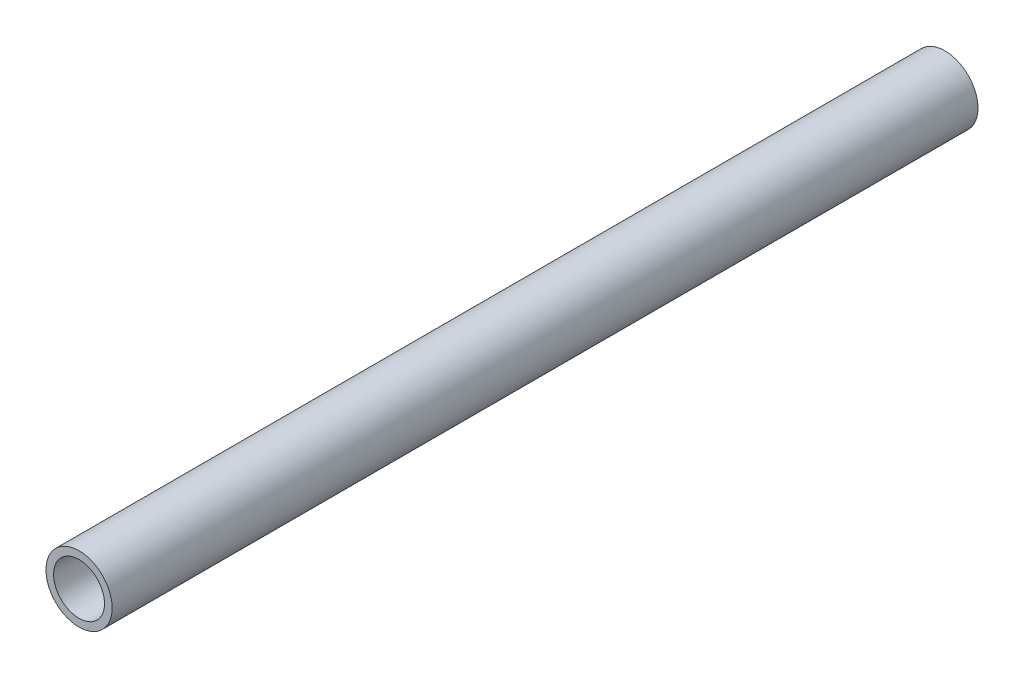
ISO-10303-21;
HEADER;
FILE_DESCRIPTION(('STEP AP214'),'2;1');
FILE_NAME('part.step','',(''),(''),'','','');
FILE_SCHEMA(('AUTOMOTIVE_DESIGN { 1 0 10303 214 1 1 1 1 }'));
ENDSEC;
DATA;
#1=APPLICATION_CONTEXT('core data for automotive mechanical design processes');
#2=APPLICATION_PROTOCOL_DEFINITION('international standard','automotive_design',2000,#1);
#3=PRODUCT_CONTEXT('',#1,'mechanical');
#4=PRODUCT('Part','Part','',(#3));
#5=PRODUCT_RELATED_PRODUCT_CATEGORY('part','',(#4));
#6=PRODUCT_DEFINITION_FORMATION('','',#4);
#7=PRODUCT_DEFINITION_CONTEXT('part definition',#1,'design');
#8=PRODUCT_DEFINITION('design','',#6,#7);
#9=PRODUCT_DEFINITION_SHAPE('','',#8);
#10=(LENGTH_UNIT() NAMED_UNIT(*) SI_UNIT(.MILLI.,.METRE.));
#11=(NAMED_UNIT(*) PLANE_ANGLE_UNIT() SI_UNIT($,.RADIAN.));
#12=(NAMED_UNIT(*) SI_UNIT($,.STERADIAN.) SOLID_ANGLE_UNIT());
#13=UNCERTAINTY_MEASURE_WITH_UNIT(LENGTH_MEASURE(1.E-05),#10,'distance_accuracy_value','');
#14=(GEOMETRIC_REPRESENTATION_CONTEXT(3) GLOBAL_UNCERTAINTY_ASSIGNED_CONTEXT((#13)) GLOBAL_UNIT_ASSIGNED_CONTEXT((#10,
#11,#12)) REPRESENTATION_CONTEXT('',''));
#15=CARTESIAN_POINT('',(0.,0.,0.));
#16=DIRECTION('',(0.,0.,1.));
#17=DIRECTION('',(1.,0.,0.));
#18=AXIS2_PLACEMENT_3D('',#15,#16,#17);
#19=CARTESIAN_POINT('',(0.,0.,170.));
#20=DIRECTION('',(0.,0.,1.));
#21=DIRECTION('',(1.,0.,0.));
#22=AXIS2_PLACEMENT_3D('',#19,#20,#21);
#23=PLANE('',#22);
#24=CARTESIAN_POINT('',(0.,0.,170.));
#25=DIRECTION('',(0.,0.,1.));
#26=DIRECTION('',(1.,0.,0.));
#27=AXIS2_PLACEMENT_3D('',#24,#25,#26);
#28=CIRCLE('',#27,6.5);
#29=CARTESIAN_POINT('',(6.5,0.,170.));
#30=VERTEX_POINT('',#29);
#31=EDGE_CURVE('E11',#30,#30,#28,.T.);
#32=ORIENTED_EDGE('',*,*,#31,.T.);
#33=EDGE_LOOP('',(#32));
#34=FACE_BOUND('',#33,.T.);
#35=CARTESIAN_POINT('',(0.,0.,170.));
#36=DIRECTION('',(0.,0.,1.));
#37=DIRECTION('',(1.,0.,0.));
#38=AXIS2_PLACEMENT_3D('',#35,#36,#37);
#39=CIRCLE('',#38,5.);
#40=CARTESIAN_POINT('',(5.,0.,170.));
#41=VERTEX_POINT('',#40);
#42=EDGE_CURVE('E56',#41,#41,#39,.T.);
#43=ORIENTED_EDGE('',*,*,#42,.F.);
#44=EDGE_LOOP('',(#43));
#45=FACE_BOUND('',#44,.T.);
#46=ADVANCED_FACE('F43',(#34,#45),#23,.T.);
#47=CARTESIAN_POINT('',(0.,0.,0.));
#48=DIRECTION('',(0.,0.,1.));
#49=DIRECTION('',(1.,0.,0.));
#50=AXIS2_PLACEMENT_3D('',#47,#48,#49);
#51=PLANE('',#50);
#52=CARTESIAN_POINT('',(0.,0.,0.));
#53=DIRECTION('',(0.,0.,1.));
#54=DIRECTION('',(1.,0.,0.));
#55=AXIS2_PLACEMENT_3D('',#52,#53,#54);
#56=CIRCLE('',#55,6.5);
#57=CARTESIAN_POINT('',(6.5,0.,0.));
#58=VERTEX_POINT('',#57);
#59=EDGE_CURVE('E47',#58,#58,#56,.T.);
#60=ORIENTED_EDGE('',*,*,#59,.F.);
#61=EDGE_LOOP('',(#60));
#62=FACE_BOUND('',#61,.T.);
#63=CARTESIAN_POINT('',(0.,0.,0.));
#64=DIRECTION('',(0.,0.,1.));
#65=DIRECTION('',(1.,0.,0.));
#66=AXIS2_PLACEMENT_3D('',#63,#64,#65);
#67=CIRCLE('',#66,5.);
#68=CARTESIAN_POINT('',(5.,0.,0.));
#69=VERTEX_POINT('',#68);
#70=EDGE_CURVE('E58',#69,#69,#67,.T.);
#71=ORIENTED_EDGE('',*,*,#70,.T.);
#72=EDGE_LOOP('',(#71));
#73=FACE_BOUND('',#72,.T.);
#74=ADVANCED_FACE('F70',(#62,#73),#51,.F.);
#75=CARTESIAN_POINT('',(0.,0.,170.));
#76=DIRECTION('',(0.,0.,-1.));
#77=DIRECTION('',(-1.,0.,0.));
#78=AXIS2_PLACEMENT_3D('',#75,#76,#77);
#79=CYLINDRICAL_SURFACE('',#78,6.5);
#80=ORIENTED_EDGE('',*,*,#31,.F.);
#81=EDGE_LOOP('',(#80));
#82=FACE_BOUND('',#81,.T.);
#83=ORIENTED_EDGE('',*,*,#59,.T.);
#84=EDGE_LOOP('',(#83));
#85=FACE_BOUND('',#84,.T.);
#86=ADVANCED_FACE('F45',(#82,#85),#79,.T.);
#87=CARTESIAN_POINT('',(0.,0.,170.));
#88=DIRECTION('',(0.,0.,-1.));
#89=DIRECTION('',(-1.,0.,0.));
#90=AXIS2_PLACEMENT_3D('',#87,#88,#89);
#91=CYLINDRICAL_SURFACE('',#90,5.);
#92=ORIENTED_EDGE('',*,*,#42,.T.);
#93=EDGE_LOOP('',(#92));
#94=FACE_BOUND('',#93,.T.);
#95=ORIENTED_EDGE('',*,*,#70,.F.);
#96=EDGE_LOOP('',(#95));
#97=FACE_BOUND('',#96,.T.);
#98=ADVANCED_FACE('F66',(#94,#97),#91,.F.);
#99=CLOSED_SHELL('',(#46,#74,#86,#98));
#100=MANIFOLD_SOLID_BREP('B2',#99);
#101=ADVANCED_BREP_SHAPE_REPRESENTATION('',(#18,#100),#14);
#102=SHAPE_DEFINITION_REPRESENTATION(#9,#101);
ENDSEC;
END-ISO-10303-21;
